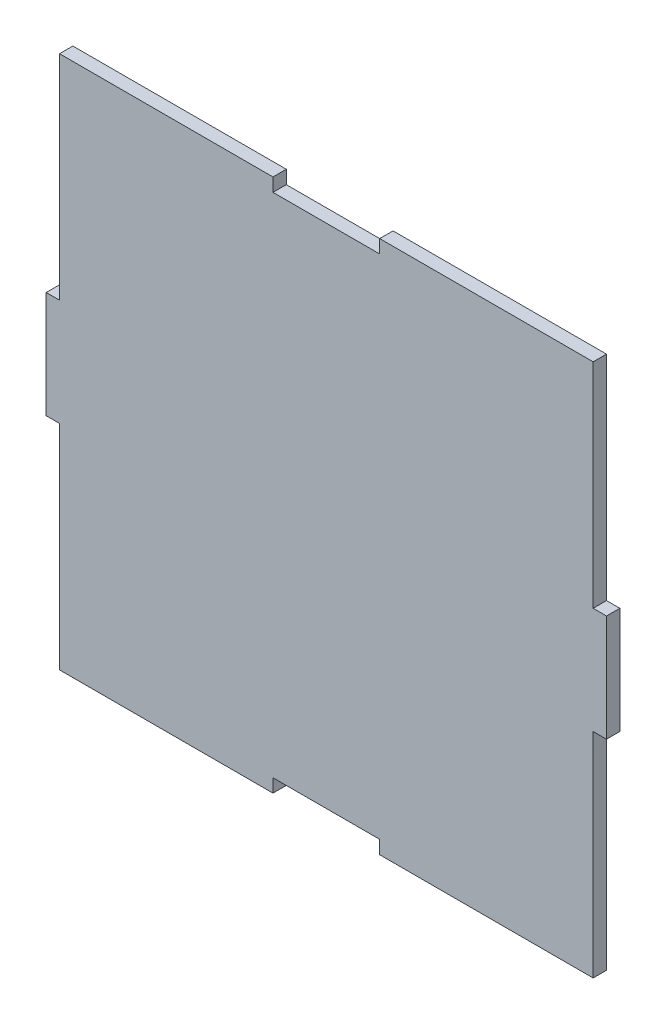
ISO-10303-21;
HEADER;
FILE_DESCRIPTION(('STEP AP214'),'2;1');
FILE_NAME('part.step','',(''),(''),'','','');
FILE_SCHEMA(('AUTOMOTIVE_DESIGN { 1 0 10303 214 1 1 1 1 }'));
ENDSEC;
DATA;
#1=APPLICATION_CONTEXT('core data for automotive mechanical design processes');
#2=APPLICATION_PROTOCOL_DEFINITION('international standard','automotive_design',2000,#1);
#3=PRODUCT_CONTEXT('',#1,'mechanical');
#4=PRODUCT('Part','Part','',(#3));
#5=PRODUCT_RELATED_PRODUCT_CATEGORY('part','',(#4));
#6=PRODUCT_DEFINITION_FORMATION('','',#4);
#7=PRODUCT_DEFINITION_CONTEXT('part definition',#1,'design');
#8=PRODUCT_DEFINITION('design','',#6,#7);
#9=PRODUCT_DEFINITION_SHAPE('','',#8);
#10=(LENGTH_UNIT() NAMED_UNIT(*) SI_UNIT(.MILLI.,.METRE.));
#11=(NAMED_UNIT(*) PLANE_ANGLE_UNIT() SI_UNIT($,.RADIAN.));
#12=(NAMED_UNIT(*) SI_UNIT($,.STERADIAN.) SOLID_ANGLE_UNIT());
#13=UNCERTAINTY_MEASURE_WITH_UNIT(LENGTH_MEASURE(1.E-05),#10,'distance_accuracy_value','');
#14=(GEOMETRIC_REPRESENTATION_CONTEXT(3) GLOBAL_UNCERTAINTY_ASSIGNED_CONTEXT((#13)) GLOBAL_UNIT_ASSIGNED_CONTEXT((#10,
#11,#12)) REPRESENTATION_CONTEXT('',''));
#15=CARTESIAN_POINT('',(0.,0.,0.));
#16=DIRECTION('',(0.,0.,1.));
#17=DIRECTION('',(1.,0.,0.));
#18=AXIS2_PLACEMENT_3D('',#15,#16,#17);
#19=CARTESIAN_POINT('',(99.9999999999999,20.,5.));
#20=DIRECTION('',(-1.,0.,0.));
#21=DIRECTION('',(0.,-1.,0.));
#22=AXIS2_PLACEMENT_3D('',#19,#20,#21);
#23=PLANE('',#22);
#24=DIRECTION('',(0.,1.,0.));
#25=VECTOR('',#24,1.);
#26=CARTESIAN_POINT('',(99.9999999999999,20.,0.));
#27=LINE('',#26,#25);
#28=CARTESIAN_POINT('',(99.9999999999999,20.,0.));
#29=VERTEX_POINT('',#28);
#30=CARTESIAN_POINT('',(100.,100.,0.));
#31=VERTEX_POINT('',#30);
#32=EDGE_CURVE('E201',#29,#31,#27,.T.);
#33=ORIENTED_EDGE('',*,*,#32,.T.);
#34=DIRECTION('',(0.,0.,-1.));
#35=VECTOR('',#34,1.);
#36=CARTESIAN_POINT('',(100.,100.,5.));
#37=LINE('',#36,#35);
#38=CARTESIAN_POINT('',(100.,100.,5.));
#39=VERTEX_POINT('',#38);
#40=EDGE_CURVE('E11',#39,#31,#37,.T.);
#41=ORIENTED_EDGE('',*,*,#40,.F.);
#42=DIRECTION('',(0.,1.,0.));
#43=VECTOR('',#42,1.);
#44=CARTESIAN_POINT('',(99.9999999999999,20.,5.));
#45=LINE('',#44,#43);
#46=CARTESIAN_POINT('',(99.9999999999999,20.,5.));
#47=VERTEX_POINT('',#46);
#48=EDGE_CURVE('E239',#47,#39,#45,.T.);
#49=ORIENTED_EDGE('',*,*,#48,.F.);
#50=DIRECTION('',(0.,0.,-1.));
#51=VECTOR('',#50,1.);
#52=CARTESIAN_POINT('',(99.9999999999999,20.,5.));
#53=LINE('',#52,#51);
#54=EDGE_CURVE('E197',#47,#29,#53,.T.);
#55=ORIENTED_EDGE('',*,*,#54,.T.);
#56=EDGE_LOOP('',(#33,#41,#49,#55));
#57=FACE_BOUND('',#56,.T.);
#58=ADVANCED_FACE('F33',(#57),#23,.F.);
#59=CARTESIAN_POINT('',(20.,100.,5.));
#60=DIRECTION('',(0.,-1.,0.));
#61=DIRECTION('',(1.,0.,0.));
#62=AXIS2_PLACEMENT_3D('',#59,#60,#61);
#63=PLANE('',#62);
#64=DIRECTION('',(-1.,0.,0.));
#65=VECTOR('',#64,1.);
#66=CARTESIAN_POINT('',(20.,100.,0.));
#67=LINE('',#66,#65);
#68=CARTESIAN_POINT('',(20.,100.,0.));
#69=VERTEX_POINT('',#68);
#70=EDGE_CURVE('E204',#31,#69,#67,.T.);
#71=ORIENTED_EDGE('',*,*,#70,.T.);
#72=DIRECTION('',(0.,0.,-1.));
#73=VECTOR('',#72,1.);
#74=CARTESIAN_POINT('',(20.,100.,5.));
#75=LINE('',#74,#73);
#76=CARTESIAN_POINT('',(20.,100.,5.));
#77=VERTEX_POINT('',#76);
#78=EDGE_CURVE('E41',#77,#69,#75,.T.);
#79=ORIENTED_EDGE('',*,*,#78,.F.);
#80=DIRECTION('',(-1.,0.,0.));
#81=VECTOR('',#80,1.);
#82=CARTESIAN_POINT('',(20.,100.,5.));
#83=LINE('',#82,#81);
#84=EDGE_CURVE('E128',#39,#77,#83,.T.);
#85=ORIENTED_EDGE('',*,*,#84,.F.);
#86=ORIENTED_EDGE('',*,*,#40,.T.);
#87=EDGE_LOOP('',(#71,#79,#85,#86));
#88=FACE_BOUND('',#87,.T.);
#89=ADVANCED_FACE('F357',(#88),#63,.F.);
#90=CARTESIAN_POINT('',(20.,100.,5.));
#91=DIRECTION('',(1.,0.,0.));
#92=DIRECTION('',(0.,1.,0.));
#93=AXIS2_PLACEMENT_3D('',#90,#91,#92);
#94=PLANE('',#93);
#95=DIRECTION('',(0.,-1.,0.));
#96=VECTOR('',#95,1.);
#97=CARTESIAN_POINT('',(20.,100.,0.));
#98=LINE('',#97,#96);
#99=CARTESIAN_POINT('',(20.,95.,0.));
#100=VERTEX_POINT('',#99);
#101=EDGE_CURVE('E206',#69,#100,#98,.T.);
#102=ORIENTED_EDGE('',*,*,#101,.T.);
#103=DIRECTION('',(0.,0.,-1.));
#104=VECTOR('',#103,1.);
#105=CARTESIAN_POINT('',(20.,95.,5.));
#106=LINE('',#105,#104);
#107=CARTESIAN_POINT('',(20.,95.,5.));
#108=VERTEX_POINT('',#107);
#109=EDGE_CURVE('E282',#108,#100,#106,.T.);
#110=ORIENTED_EDGE('',*,*,#109,.F.);
#111=DIRECTION('',(0.,-1.,0.));
#112=VECTOR('',#111,1.);
#113=CARTESIAN_POINT('',(20.,100.,5.));
#114=LINE('',#113,#112);
#115=EDGE_CURVE('E290',#77,#108,#114,.T.);
#116=ORIENTED_EDGE('',*,*,#115,.F.);
#117=ORIENTED_EDGE('',*,*,#78,.T.);
#118=EDGE_LOOP('',(#102,#110,#116,#117));
#119=FACE_BOUND('',#118,.T.);
#120=ADVANCED_FACE('F288',(#119),#94,.F.);
#121=CARTESIAN_POINT('',(-20.,95.,5.));
#122=DIRECTION('',(0.,-1.,0.));
#123=DIRECTION('',(0.,0.,-1.));
#124=AXIS2_PLACEMENT_3D('',#121,#122,#123);
#125=PLANE('',#124);
#126=DIRECTION('',(-1.,0.,0.));
#127=VECTOR('',#126,1.);
#128=CARTESIAN_POINT('',(-20.,95.,0.));
#129=LINE('',#128,#127);
#130=CARTESIAN_POINT('',(-20.,95.,0.));
#131=VERTEX_POINT('',#130);
#132=EDGE_CURVE('E208',#100,#131,#129,.T.);
#133=ORIENTED_EDGE('',*,*,#132,.T.);
#134=DIRECTION('',(0.,0.,-1.));
#135=VECTOR('',#134,1.);
#136=CARTESIAN_POINT('',(-20.,95.,5.));
#137=LINE('',#136,#135);
#138=CARTESIAN_POINT('',(-20.,95.,5.));
#139=VERTEX_POINT('',#138);
#140=EDGE_CURVE('E279',#139,#131,#137,.T.);
#141=ORIENTED_EDGE('',*,*,#140,.F.);
#142=DIRECTION('',(-1.,0.,0.));
#143=VECTOR('',#142,1.);
#144=CARTESIAN_POINT('',(-20.,95.,5.));
#145=LINE('',#144,#143);
#146=EDGE_CURVE('E308',#108,#139,#145,.T.);
#147=ORIENTED_EDGE('',*,*,#146,.F.);
#148=ORIENTED_EDGE('',*,*,#109,.T.);
#149=EDGE_LOOP('',(#133,#141,#147,#148));
#150=FACE_BOUND('',#149,.T.);
#151=ADVANCED_FACE('F299',(#150),#125,.F.);
#152=CARTESIAN_POINT('',(-20.,100.,5.));
#153=DIRECTION('',(-1.,0.,0.));
#154=DIRECTION('',(0.,-1.,0.));
#155=AXIS2_PLACEMENT_3D('',#152,#153,#154);
#156=PLANE('',#155);
#157=DIRECTION('',(0.,1.,0.));
#158=VECTOR('',#157,1.);
#159=CARTESIAN_POINT('',(-20.,100.,0.));
#160=LINE('',#159,#158);
#161=CARTESIAN_POINT('',(-20.,100.,0.));
#162=VERTEX_POINT('',#161);
#163=EDGE_CURVE('E210',#131,#162,#160,.T.);
#164=ORIENTED_EDGE('',*,*,#163,.T.);
#165=DIRECTION('',(0.,0.,-1.));
#166=VECTOR('',#165,1.);
#167=CARTESIAN_POINT('',(-20.,100.,5.));
#168=LINE('',#167,#166);
#169=CARTESIAN_POINT('',(-20.,100.,5.));
#170=VERTEX_POINT('',#169);
#171=EDGE_CURVE('E276',#170,#162,#168,.T.);
#172=ORIENTED_EDGE('',*,*,#171,.F.);
#173=DIRECTION('',(0.,1.,0.));
#174=VECTOR('',#173,1.);
#175=CARTESIAN_POINT('',(-20.,100.,5.));
#176=LINE('',#175,#174);
#177=EDGE_CURVE('E305',#139,#170,#176,.T.);
#178=ORIENTED_EDGE('',*,*,#177,.F.);
#179=ORIENTED_EDGE('',*,*,#140,.T.);
#180=EDGE_LOOP('',(#164,#172,#178,#179));
#181=FACE_BOUND('',#180,.T.);
#182=ADVANCED_FACE('F303',(#181),#156,.F.);
#183=CARTESIAN_POINT('',(-100.,100.,5.));
#184=DIRECTION('',(0.,-1.,0.));
#185=DIRECTION('',(1.,0.,0.));
#186=AXIS2_PLACEMENT_3D('',#183,#184,#185);
#187=PLANE('',#186);
#188=DIRECTION('',(-1.,0.,0.));
#189=VECTOR('',#188,1.);
#190=CARTESIAN_POINT('',(-100.,100.,0.));
#191=LINE('',#190,#189);
#192=CARTESIAN_POINT('',(-100.,100.,0.));
#193=VERTEX_POINT('',#192);
#194=EDGE_CURVE('E212',#162,#193,#191,.T.);
#195=ORIENTED_EDGE('',*,*,#194,.T.);
#196=DIRECTION('',(0.,0.,-1.));
#197=VECTOR('',#196,1.);
#198=CARTESIAN_POINT('',(-100.,100.,5.));
#199=LINE('',#198,#197);
#200=CARTESIAN_POINT('',(-100.,100.,5.));
#201=VERTEX_POINT('',#200);
#202=EDGE_CURVE('E273',#201,#193,#199,.T.);
#203=ORIENTED_EDGE('',*,*,#202,.F.);
#204=DIRECTION('',(-1.,0.,0.));
#205=VECTOR('',#204,1.);
#206=CARTESIAN_POINT('',(-100.,100.,5.));
#207=LINE('',#206,#205);
#208=EDGE_CURVE('E307',#170,#201,#207,.T.);
#209=ORIENTED_EDGE('',*,*,#208,.F.);
#210=ORIENTED_EDGE('',*,*,#171,.T.);
#211=EDGE_LOOP('',(#195,#203,#209,#210));
#212=FACE_BOUND('',#211,.T.);
#213=ADVANCED_FACE('F370',(#212),#187,.F.);
#214=CARTESIAN_POINT('',(-100.,20.,5.));
#215=DIRECTION('',(1.,0.,0.));
#216=DIRECTION('',(0.,1.,0.));
#217=AXIS2_PLACEMENT_3D('',#214,#215,#216);
#218=PLANE('',#217);
#219=DIRECTION('',(0.,-1.,0.));
#220=VECTOR('',#219,1.);
#221=CARTESIAN_POINT('',(-100.,20.,0.));
#222=LINE('',#221,#220);
#223=CARTESIAN_POINT('',(-100.,20.,0.));
#224=VERTEX_POINT('',#223);
#225=EDGE_CURVE('E214',#193,#224,#222,.T.);
#226=ORIENTED_EDGE('',*,*,#225,.T.);
#227=DIRECTION('',(0.,0.,-1.));
#228=VECTOR('',#227,1.);
#229=CARTESIAN_POINT('',(-100.,20.,5.));
#230=LINE('',#229,#228);
#231=CARTESIAN_POINT('',(-100.,20.,5.));
#232=VERTEX_POINT('',#231);
#233=EDGE_CURVE('E270',#232,#224,#230,.T.);
#234=ORIENTED_EDGE('',*,*,#233,.F.);
#235=DIRECTION('',(0.,-1.,0.));
#236=VECTOR('',#235,1.);
#237=CARTESIAN_POINT('',(-100.,20.,5.));
#238=LINE('',#237,#236);
#239=EDGE_CURVE('E310',#201,#232,#238,.T.);
#240=ORIENTED_EDGE('',*,*,#239,.F.);
#241=ORIENTED_EDGE('',*,*,#202,.T.);
#242=EDGE_LOOP('',(#226,#234,#240,#241));
#243=FACE_BOUND('',#242,.T.);
#244=ADVANCED_FACE('F373',(#243),#218,.F.);
#245=CARTESIAN_POINT('',(-100.,20.,5.));
#246=DIRECTION('',(0.,-1.,0.));
#247=DIRECTION('',(1.,0.,0.));
#248=AXIS2_PLACEMENT_3D('',#245,#246,#247);
#249=PLANE('',#248);
#250=DIRECTION('',(-1.,0.,0.));
#251=VECTOR('',#250,1.);
#252=CARTESIAN_POINT('',(-100.,20.,0.));
#253=LINE('',#252,#251);
#254=CARTESIAN_POINT('',(-105.,20.,0.));
#255=VERTEX_POINT('',#254);
#256=EDGE_CURVE('E216',#224,#255,#253,.T.);
#257=ORIENTED_EDGE('',*,*,#256,.T.);
#258=DIRECTION('',(0.,0.,-1.));
#259=VECTOR('',#258,1.);
#260=CARTESIAN_POINT('',(-105.,20.,5.));
#261=LINE('',#260,#259);
#262=CARTESIAN_POINT('',(-105.,20.,5.));
#263=VERTEX_POINT('',#262);
#264=EDGE_CURVE('E267',#263,#255,#261,.T.);
#265=ORIENTED_EDGE('',*,*,#264,.F.);
#266=DIRECTION('',(-1.,0.,0.));
#267=VECTOR('',#266,1.);
#268=CARTESIAN_POINT('',(-100.,20.,5.));
#269=LINE('',#268,#267);
#270=EDGE_CURVE('E316',#232,#263,#269,.T.);
#271=ORIENTED_EDGE('',*,*,#270,.F.);
#272=ORIENTED_EDGE('',*,*,#233,.T.);
#273=EDGE_LOOP('',(#257,#265,#271,#272));
#274=FACE_BOUND('',#273,.T.);
#275=ADVANCED_FACE('F377',(#274),#249,.F.);
#276=CARTESIAN_POINT('',(-105.,20.,5.));
#277=DIRECTION('',(1.,0.,0.));
#278=DIRECTION('',(0.,1.,0.));
#279=AXIS2_PLACEMENT_3D('',#276,#277,#278);
#280=PLANE('',#279);
#281=DIRECTION('',(0.,-1.,0.));
#282=VECTOR('',#281,1.);
#283=CARTESIAN_POINT('',(-105.,20.,0.));
#284=LINE('',#283,#282);
#285=CARTESIAN_POINT('',(-105.,-20.,0.));
#286=VERTEX_POINT('',#285);
#287=EDGE_CURVE('E218',#255,#286,#284,.T.);
#288=ORIENTED_EDGE('',*,*,#287,.T.);
#289=DIRECTION('',(0.,0.,-1.));
#290=VECTOR('',#289,1.);
#291=CARTESIAN_POINT('',(-105.,-20.,5.));
#292=LINE('',#291,#290);
#293=CARTESIAN_POINT('',(-105.,-20.,5.));
#294=VERTEX_POINT('',#293);
#295=EDGE_CURVE('E264',#294,#286,#292,.T.);
#296=ORIENTED_EDGE('',*,*,#295,.F.);
#297=DIRECTION('',(0.,-1.,0.));
#298=VECTOR('',#297,1.);
#299=CARTESIAN_POINT('',(-105.,20.,5.));
#300=LINE('',#299,#298);
#301=EDGE_CURVE('E318',#263,#294,#300,.T.);
#302=ORIENTED_EDGE('',*,*,#301,.F.);
#303=ORIENTED_EDGE('',*,*,#264,.T.);
#304=EDGE_LOOP('',(#288,#296,#302,#303));
#305=FACE_BOUND('',#304,.T.);
#306=ADVANCED_FACE('F381',(#305),#280,.F.);
#307=CARTESIAN_POINT('',(-100.,-20.,5.));
#308=DIRECTION('',(0.,1.,0.));
#309=DIRECTION('',(-1.,0.,0.));
#310=AXIS2_PLACEMENT_3D('',#307,#308,#309);
#311=PLANE('',#310);
#312=DIRECTION('',(1.,0.,0.));
#313=VECTOR('',#312,1.);
#314=CARTESIAN_POINT('',(-100.,-20.,0.));
#315=LINE('',#314,#313);
#316=CARTESIAN_POINT('',(-100.,-20.,0.));
#317=VERTEX_POINT('',#316);
#318=EDGE_CURVE('E220',#286,#317,#315,.T.);
#319=ORIENTED_EDGE('',*,*,#318,.T.);
#320=DIRECTION('',(0.,0.,-1.));
#321=VECTOR('',#320,1.);
#322=CARTESIAN_POINT('',(-100.,-20.,5.));
#323=LINE('',#322,#321);
#324=CARTESIAN_POINT('',(-100.,-20.,5.));
#325=VERTEX_POINT('',#324);
#326=EDGE_CURVE('E261',#325,#317,#323,.T.);
#327=ORIENTED_EDGE('',*,*,#326,.F.);
#328=DIRECTION('',(1.,0.,0.));
#329=VECTOR('',#328,1.);
#330=CARTESIAN_POINT('',(-100.,-20.,5.));
#331=LINE('',#330,#329);
#332=EDGE_CURVE('E320',#294,#325,#331,.T.);
#333=ORIENTED_EDGE('',*,*,#332,.F.);
#334=ORIENTED_EDGE('',*,*,#295,.T.);
#335=EDGE_LOOP('',(#319,#327,#333,#334));
#336=FACE_BOUND('',#335,.T.);
#337=ADVANCED_FACE('F385',(#336),#311,.F.);
#338=CARTESIAN_POINT('',(-100.,-100.,5.));
#339=DIRECTION('',(1.,0.,0.));
#340=DIRECTION('',(0.,1.,0.));
#341=AXIS2_PLACEMENT_3D('',#338,#339,#340);
#342=PLANE('',#341);
#343=DIRECTION('',(0.,-1.,0.));
#344=VECTOR('',#343,1.);
#345=CARTESIAN_POINT('',(-100.,-100.,0.));
#346=LINE('',#345,#344);
#347=CARTESIAN_POINT('',(-100.,-100.,0.));
#348=VERTEX_POINT('',#347);
#349=EDGE_CURVE('E222',#317,#348,#346,.T.);
#350=ORIENTED_EDGE('',*,*,#349,.T.);
#351=DIRECTION('',(0.,0.,-1.));
#352=VECTOR('',#351,1.);
#353=CARTESIAN_POINT('',(-100.,-100.,5.));
#354=LINE('',#353,#352);
#355=CARTESIAN_POINT('',(-100.,-100.,5.));
#356=VERTEX_POINT('',#355);
#357=EDGE_CURVE('E258',#356,#348,#354,.T.);
#358=ORIENTED_EDGE('',*,*,#357,.F.);
#359=DIRECTION('',(0.,-1.,0.));
#360=VECTOR('',#359,1.);
#361=CARTESIAN_POINT('',(-100.,-100.,5.));
#362=LINE('',#361,#360);
#363=EDGE_CURVE('E322',#325,#356,#362,.T.);
#364=ORIENTED_EDGE('',*,*,#363,.F.);
#365=ORIENTED_EDGE('',*,*,#326,.T.);
#366=EDGE_LOOP('',(#350,#358,#364,#365));
#367=FACE_BOUND('',#366,.T.);
#368=ADVANCED_FACE('F389',(#367),#342,.F.);
#369=CARTESIAN_POINT('',(-100.,-100.,5.));
#370=DIRECTION('',(0.,1.,0.));
#371=DIRECTION('',(-1.,0.,0.));
#372=AXIS2_PLACEMENT_3D('',#369,#370,#371);
#373=PLANE('',#372);
#374=DIRECTION('',(1.,0.,0.));
#375=VECTOR('',#374,1.);
#376=CARTESIAN_POINT('',(-100.,-100.,0.));
#377=LINE('',#376,#375);
#378=CARTESIAN_POINT('',(-20.,-100.,0.));
#379=VERTEX_POINT('',#378);
#380=EDGE_CURVE('E224',#348,#379,#377,.T.);
#381=ORIENTED_EDGE('',*,*,#380,.T.);
#382=DIRECTION('',(0.,0.,-1.));
#383=VECTOR('',#382,1.);
#384=CARTESIAN_POINT('',(-20.,-100.,5.));
#385=LINE('',#384,#383);
#386=CARTESIAN_POINT('',(-20.,-100.,5.));
#387=VERTEX_POINT('',#386);
#388=EDGE_CURVE('E255',#387,#379,#385,.T.);
#389=ORIENTED_EDGE('',*,*,#388,.F.);
#390=DIRECTION('',(1.,0.,0.));
#391=VECTOR('',#390,1.);
#392=CARTESIAN_POINT('',(-100.,-100.,5.));
#393=LINE('',#392,#391);
#394=EDGE_CURVE('E324',#356,#387,#393,.T.);
#395=ORIENTED_EDGE('',*,*,#394,.F.);
#396=ORIENTED_EDGE('',*,*,#357,.T.);
#397=EDGE_LOOP('',(#381,#389,#395,#396));
#398=FACE_BOUND('',#397,.T.);
#399=ADVANCED_FACE('F393',(#398),#373,.F.);
#400=CARTESIAN_POINT('',(-20.,-100.,5.));
#401=DIRECTION('',(-1.,0.,0.));
#402=DIRECTION('',(0.,-1.,0.));
#403=AXIS2_PLACEMENT_3D('',#400,#401,#402);
#404=PLANE('',#403);
#405=DIRECTION('',(0.,1.,0.));
#406=VECTOR('',#405,1.);
#407=CARTESIAN_POINT('',(-20.,-100.,0.));
#408=LINE('',#407,#406);
#409=CARTESIAN_POINT('',(-19.9999999999999,-95.,0.));
#410=VERTEX_POINT('',#409);
#411=EDGE_CURVE('E226',#379,#410,#408,.T.);
#412=ORIENTED_EDGE('',*,*,#411,.T.);
#413=DIRECTION('',(0.,0.,-1.));
#414=VECTOR('',#413,1.);
#415=CARTESIAN_POINT('',(-19.9999999999999,-95.,5.));
#416=LINE('',#415,#414);
#417=CARTESIAN_POINT('',(-19.9999999999999,-95.,5.));
#418=VERTEX_POINT('',#417);
#419=EDGE_CURVE('E252',#418,#410,#416,.T.);
#420=ORIENTED_EDGE('',*,*,#419,.F.);
#421=DIRECTION('',(0.,1.,0.));
#422=VECTOR('',#421,1.);
#423=CARTESIAN_POINT('',(-20.,-100.,5.));
#424=LINE('',#423,#422);
#425=EDGE_CURVE('E326',#387,#418,#424,.T.);
#426=ORIENTED_EDGE('',*,*,#425,.F.);
#427=ORIENTED_EDGE('',*,*,#388,.T.);
#428=EDGE_LOOP('',(#412,#420,#426,#427));
#429=FACE_BOUND('',#428,.T.);
#430=ADVANCED_FACE('F397',(#429),#404,.F.);
#431=CARTESIAN_POINT('',(-19.9999999999999,-95.,5.));
#432=DIRECTION('',(0.,1.,0.));
#433=DIRECTION('',(0.,0.,1.));
#434=AXIS2_PLACEMENT_3D('',#431,#432,#433);
#435=PLANE('',#434);
#436=DIRECTION('',(1.,0.,0.));
#437=VECTOR('',#436,1.);
#438=CARTESIAN_POINT('',(-19.9999999999999,-95.,0.));
#439=LINE('',#438,#437);
#440=CARTESIAN_POINT('',(20.,-95.,0.));
#441=VERTEX_POINT('',#440);
#442=EDGE_CURVE('E228',#410,#441,#439,.T.);
#443=ORIENTED_EDGE('',*,*,#442,.T.);
#444=DIRECTION('',(0.,0.,-1.));
#445=VECTOR('',#444,1.);
#446=CARTESIAN_POINT('',(20.,-95.,5.));
#447=LINE('',#446,#445);
#448=CARTESIAN_POINT('',(20.,-95.,5.));
#449=VERTEX_POINT('',#448);
#450=EDGE_CURVE('E249',#449,#441,#447,.T.);
#451=ORIENTED_EDGE('',*,*,#450,.F.);
#452=DIRECTION('',(1.,0.,0.));
#453=VECTOR('',#452,1.);
#454=CARTESIAN_POINT('',(-19.9999999999999,-95.,5.));
#455=LINE('',#454,#453);
#456=EDGE_CURVE('E328',#418,#449,#455,.T.);
#457=ORIENTED_EDGE('',*,*,#456,.F.);
#458=ORIENTED_EDGE('',*,*,#419,.T.);
#459=EDGE_LOOP('',(#443,#451,#457,#458));
#460=FACE_BOUND('',#459,.T.);
#461=ADVANCED_FACE('F401',(#460),#435,.F.);
#462=CARTESIAN_POINT('',(20.,-100.,5.));
#463=DIRECTION('',(1.,0.,0.));
#464=DIRECTION('',(0.,1.,0.));
#465=AXIS2_PLACEMENT_3D('',#462,#463,#464);
#466=PLANE('',#465);
#467=DIRECTION('',(0.,-1.,0.));
#468=VECTOR('',#467,1.);
#469=CARTESIAN_POINT('',(20.,-100.,0.));
#470=LINE('',#469,#468);
#471=CARTESIAN_POINT('',(20.,-100.,0.));
#472=VERTEX_POINT('',#471);
#473=EDGE_CURVE('E230',#441,#472,#470,.T.);
#474=ORIENTED_EDGE('',*,*,#473,.T.);
#475=DIRECTION('',(0.,0.,-1.));
#476=VECTOR('',#475,1.);
#477=CARTESIAN_POINT('',(20.,-100.,5.));
#478=LINE('',#477,#476);
#479=CARTESIAN_POINT('',(20.,-100.,5.));
#480=VERTEX_POINT('',#479);
#481=EDGE_CURVE('E246',#480,#472,#478,.T.);
#482=ORIENTED_EDGE('',*,*,#481,.F.);
#483=DIRECTION('',(0.,-1.,0.));
#484=VECTOR('',#483,1.);
#485=CARTESIAN_POINT('',(20.,-100.,5.));
#486=LINE('',#485,#484);
#487=EDGE_CURVE('E330',#449,#480,#486,.T.);
#488=ORIENTED_EDGE('',*,*,#487,.F.);
#489=ORIENTED_EDGE('',*,*,#450,.T.);
#490=EDGE_LOOP('',(#474,#482,#488,#489));
#491=FACE_BOUND('',#490,.T.);
#492=ADVANCED_FACE('F405',(#491),#466,.F.);
#493=CARTESIAN_POINT('',(20.,-100.,5.));
#494=DIRECTION('',(0.,1.,0.));
#495=DIRECTION('',(-1.,0.,0.));
#496=AXIS2_PLACEMENT_3D('',#493,#494,#495);
#497=PLANE('',#496);
#498=DIRECTION('',(1.,0.,0.));
#499=VECTOR('',#498,1.);
#500=CARTESIAN_POINT('',(20.,-100.,0.));
#501=LINE('',#500,#499);
#502=CARTESIAN_POINT('',(100.,-100.,0.));
#503=VERTEX_POINT('',#502);
#504=EDGE_CURVE('E232',#472,#503,#501,.T.);
#505=ORIENTED_EDGE('',*,*,#504,.T.);
#506=DIRECTION('',(0.,0.,-1.));
#507=VECTOR('',#506,1.);
#508=CARTESIAN_POINT('',(100.,-100.,5.));
#509=LINE('',#508,#507);
#510=CARTESIAN_POINT('',(100.,-100.,5.));
#511=VERTEX_POINT('',#510);
#512=EDGE_CURVE('E243',#511,#503,#509,.T.);
#513=ORIENTED_EDGE('',*,*,#512,.F.);
#514=DIRECTION('',(1.,0.,0.));
#515=VECTOR('',#514,1.);
#516=CARTESIAN_POINT('',(20.,-100.,5.));
#517=LINE('',#516,#515);
#518=EDGE_CURVE('E332',#480,#511,#517,.T.);
#519=ORIENTED_EDGE('',*,*,#518,.F.);
#520=ORIENTED_EDGE('',*,*,#481,.T.);
#521=EDGE_LOOP('',(#505,#513,#519,#520));
#522=FACE_BOUND('',#521,.T.);
#523=ADVANCED_FACE('F338',(#522),#497,.F.);
#524=CARTESIAN_POINT('',(100.,-100.,5.));
#525=DIRECTION('',(-1.,0.,0.));
#526=DIRECTION('',(0.,-1.,0.));
#527=AXIS2_PLACEMENT_3D('',#524,#525,#526);
#528=PLANE('',#527);
#529=DIRECTION('',(0.,1.,0.));
#530=VECTOR('',#529,1.);
#531=CARTESIAN_POINT('',(100.,-100.,0.));
#532=LINE('',#531,#530);
#533=CARTESIAN_POINT('',(99.9999999999999,-20.,0.));
#534=VERTEX_POINT('',#533);
#535=EDGE_CURVE('E234',#503,#534,#532,.T.);
#536=ORIENTED_EDGE('',*,*,#535,.T.);
#537=DIRECTION('',(0.,0.,-1.));
#538=VECTOR('',#537,1.);
#539=CARTESIAN_POINT('',(99.9999999999999,-20.,5.));
#540=LINE('',#539,#538);
#541=CARTESIAN_POINT('',(99.9999999999999,-20.,5.));
#542=VERTEX_POINT('',#541);
#543=EDGE_CURVE('E192',#542,#534,#540,.T.);
#544=ORIENTED_EDGE('',*,*,#543,.F.);
#545=DIRECTION('',(0.,1.,0.));
#546=VECTOR('',#545,1.);
#547=CARTESIAN_POINT('',(100.,-100.,5.));
#548=LINE('',#547,#546);
#549=EDGE_CURVE('E183',#511,#542,#548,.T.);
#550=ORIENTED_EDGE('',*,*,#549,.F.);
#551=ORIENTED_EDGE('',*,*,#512,.T.);
#552=EDGE_LOOP('',(#536,#544,#550,#551));
#553=FACE_BOUND('',#552,.T.);
#554=ADVANCED_FACE('F342',(#553),#528,.F.);
#555=CARTESIAN_POINT('',(99.9999999999999,-20.,5.));
#556=DIRECTION('',(0.,1.,0.));
#557=DIRECTION('',(-1.,0.,0.));
#558=AXIS2_PLACEMENT_3D('',#555,#556,#557);
#559=PLANE('',#558);
#560=DIRECTION('',(1.,0.,0.));
#561=VECTOR('',#560,1.);
#562=CARTESIAN_POINT('',(99.9999999999999,-20.,0.));
#563=LINE('',#562,#561);
#564=CARTESIAN_POINT('',(105.,-20.,0.));
#565=VERTEX_POINT('',#564);
#566=EDGE_CURVE('E191',#534,#565,#563,.T.);
#567=ORIENTED_EDGE('',*,*,#566,.T.);
#568=DIRECTION('',(0.,0.,-1.));
#569=VECTOR('',#568,1.);
#570=CARTESIAN_POINT('',(105.,-20.,5.));
#571=LINE('',#570,#569);
#572=CARTESIAN_POINT('',(105.,-20.,5.));
#573=VERTEX_POINT('',#572);
#574=EDGE_CURVE('E188',#573,#565,#571,.T.);
#575=ORIENTED_EDGE('',*,*,#574,.F.);
#576=DIRECTION('',(1.,0.,0.));
#577=VECTOR('',#576,1.);
#578=CARTESIAN_POINT('',(99.9999999999999,-20.,5.));
#579=LINE('',#578,#577);
#580=EDGE_CURVE('E177',#542,#573,#579,.T.);
#581=ORIENTED_EDGE('',*,*,#580,.F.);
#582=ORIENTED_EDGE('',*,*,#543,.T.);
#583=EDGE_LOOP('',(#567,#575,#581,#582));
#584=FACE_BOUND('',#583,.T.);
#585=ADVANCED_FACE('F189',(#584),#559,.F.);
#586=CARTESIAN_POINT('',(105.,20.,5.));
#587=DIRECTION('',(-1.,0.,0.));
#588=DIRECTION('',(0.,-1.,0.));
#589=AXIS2_PLACEMENT_3D('',#586,#587,#588);
#590=PLANE('',#589);
#591=DIRECTION('',(0.,1.,0.));
#592=VECTOR('',#591,1.);
#593=CARTESIAN_POINT('',(105.,20.,0.));
#594=LINE('',#593,#592);
#595=CARTESIAN_POINT('',(105.,20.,0.));
#596=VERTEX_POINT('',#595);
#597=EDGE_CURVE('E114',#565,#596,#594,.T.);
#598=ORIENTED_EDGE('',*,*,#597,.T.);
#599=DIRECTION('',(0.,0.,-1.));
#600=VECTOR('',#599,1.);
#601=CARTESIAN_POINT('',(105.,20.,5.));
#602=LINE('',#601,#600);
#603=CARTESIAN_POINT('',(105.,20.,5.));
#604=VERTEX_POINT('',#603);
#605=EDGE_CURVE('E193',#604,#596,#602,.T.);
#606=ORIENTED_EDGE('',*,*,#605,.F.);
#607=DIRECTION('',(0.,1.,0.));
#608=VECTOR('',#607,1.);
#609=CARTESIAN_POINT('',(105.,20.,5.));
#610=LINE('',#609,#608);
#611=EDGE_CURVE('E181',#573,#604,#610,.T.);
#612=ORIENTED_EDGE('',*,*,#611,.F.);
#613=ORIENTED_EDGE('',*,*,#574,.T.);
#614=EDGE_LOOP('',(#598,#606,#612,#613));
#615=FACE_BOUND('',#614,.T.);
#616=ADVANCED_FACE('F195',(#615),#590,.F.);
#617=CARTESIAN_POINT('',(99.9999999999999,20.,5.));
#618=DIRECTION('',(0.,-1.,0.));
#619=DIRECTION('',(1.,0.,0.));
#620=AXIS2_PLACEMENT_3D('',#617,#618,#619);
#621=PLANE('',#620);
#622=DIRECTION('',(-1.,0.,0.));
#623=VECTOR('',#622,1.);
#624=CARTESIAN_POINT('',(99.9999999999999,20.,0.));
#625=LINE('',#624,#623);
#626=EDGE_CURVE('E120',#596,#29,#625,.T.);
#627=ORIENTED_EDGE('',*,*,#626,.T.);
#628=ORIENTED_EDGE('',*,*,#54,.F.);
#629=DIRECTION('',(-1.,0.,0.));
#630=VECTOR('',#629,1.);
#631=CARTESIAN_POINT('',(99.9999999999999,20.,5.));
#632=LINE('',#631,#630);
#633=EDGE_CURVE('E49',#604,#47,#632,.T.);
#634=ORIENTED_EDGE('',*,*,#633,.F.);
#635=ORIENTED_EDGE('',*,*,#605,.T.);
#636=EDGE_LOOP('',(#627,#628,#634,#635));
#637=FACE_BOUND('',#636,.T.);
#638=ADVANCED_FACE('F346',(#637),#621,.F.);
#639=CARTESIAN_POINT('',(0.,0.,5.));
#640=DIRECTION('',(0.,0.,-1.));
#641=DIRECTION('',(-1.,0.,0.));
#642=AXIS2_PLACEMENT_3D('',#639,#640,#641);
#643=PLANE('',#642);
#644=ORIENTED_EDGE('',*,*,#48,.T.);
#645=ORIENTED_EDGE('',*,*,#84,.T.);
#646=ORIENTED_EDGE('',*,*,#115,.T.);
#647=ORIENTED_EDGE('',*,*,#146,.T.);
#648=ORIENTED_EDGE('',*,*,#177,.T.);
#649=ORIENTED_EDGE('',*,*,#208,.T.);
#650=ORIENTED_EDGE('',*,*,#239,.T.);
#651=ORIENTED_EDGE('',*,*,#270,.T.);
#652=ORIENTED_EDGE('',*,*,#301,.T.);
#653=ORIENTED_EDGE('',*,*,#332,.T.);
#654=ORIENTED_EDGE('',*,*,#363,.T.);
#655=ORIENTED_EDGE('',*,*,#394,.T.);
#656=ORIENTED_EDGE('',*,*,#425,.T.);
#657=ORIENTED_EDGE('',*,*,#456,.T.);
#658=ORIENTED_EDGE('',*,*,#487,.T.);
#659=ORIENTED_EDGE('',*,*,#518,.T.);
#660=ORIENTED_EDGE('',*,*,#549,.T.);
#661=ORIENTED_EDGE('',*,*,#580,.T.);
#662=ORIENTED_EDGE('',*,*,#611,.T.);
#663=ORIENTED_EDGE('',*,*,#633,.T.);
#664=EDGE_LOOP('',(#644,#645,#646,#647,#648,#649,#650,#651,#652,#653,#654,#655,#656,#657,#658,
#659,#660,#661,#662,#663));
#665=FACE_BOUND('',#664,.T.);
#666=ADVANCED_FACE('F179',(#665),#643,.F.);
#667=CARTESIAN_POINT('',(0.,0.,0.));
#668=DIRECTION('',(0.,0.,-1.));
#669=DIRECTION('',(-1.,0.,0.));
#670=AXIS2_PLACEMENT_3D('',#667,#668,#669);
#671=PLANE('',#670);
#672=ORIENTED_EDGE('',*,*,#32,.F.);
#673=ORIENTED_EDGE('',*,*,#626,.F.);
#674=ORIENTED_EDGE('',*,*,#597,.F.);
#675=ORIENTED_EDGE('',*,*,#566,.F.);
#676=ORIENTED_EDGE('',*,*,#535,.F.);
#677=ORIENTED_EDGE('',*,*,#504,.F.);
#678=ORIENTED_EDGE('',*,*,#473,.F.);
#679=ORIENTED_EDGE('',*,*,#442,.F.);
#680=ORIENTED_EDGE('',*,*,#411,.F.);
#681=ORIENTED_EDGE('',*,*,#380,.F.);
#682=ORIENTED_EDGE('',*,*,#349,.F.);
#683=ORIENTED_EDGE('',*,*,#318,.F.);
#684=ORIENTED_EDGE('',*,*,#287,.F.);
#685=ORIENTED_EDGE('',*,*,#256,.F.);
#686=ORIENTED_EDGE('',*,*,#225,.F.);
#687=ORIENTED_EDGE('',*,*,#194,.F.);
#688=ORIENTED_EDGE('',*,*,#163,.F.);
#689=ORIENTED_EDGE('',*,*,#132,.F.);
#690=ORIENTED_EDGE('',*,*,#101,.F.);
#691=ORIENTED_EDGE('',*,*,#70,.F.);
#692=EDGE_LOOP('',(#672,#673,#674,#675,#676,#677,#678,#679,#680,#681,#682,#683,#684,#685,#686,
#687,#688,#689,#690,#691));
#693=FACE_BOUND('',#692,.T.);
#694=ADVANCED_FACE('F294',(#693),#671,.T.);
#695=CLOSED_SHELL('',(#58,#89,#120,#151,#182,#213,#244,#275,#306,#337,#368,#399,#430,#461,#492,
#523,#554,#585,#616,#638,#666,#694));
#696=MANIFOLD_SOLID_BREP('B2',#695);
#697=ADVANCED_BREP_SHAPE_REPRESENTATION('',(#18,#696),#14);
#698=SHAPE_DEFINITION_REPRESENTATION(#9,#697);
ENDSEC;
END-ISO-10303-21;
